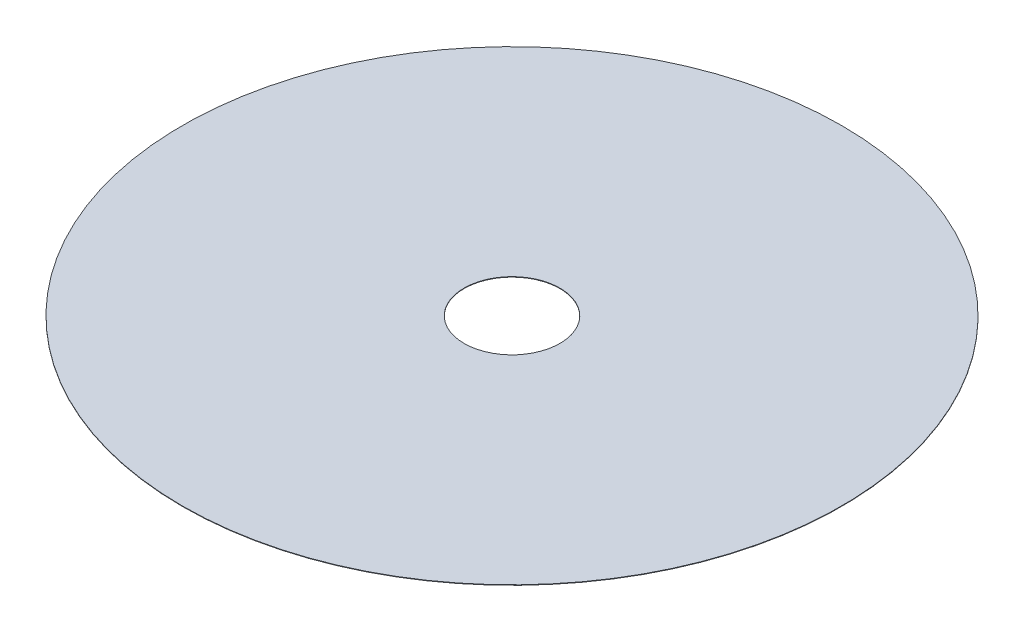
ISO-10303-21;
HEADER;
FILE_DESCRIPTION(('STEP AP214'),'2;1');
FILE_NAME('part.step','',(''),(''),'','','');
FILE_SCHEMA(('AUTOMOTIVE_DESIGN { 1 0 10303 214 1 1 1 1 }'));
ENDSEC;
DATA;
#1=APPLICATION_CONTEXT('core data for automotive mechanical design processes');
#2=APPLICATION_PROTOCOL_DEFINITION('international standard','automotive_design',2000,#1);
#3=PRODUCT_CONTEXT('',#1,'mechanical');
#4=PRODUCT('Part','Part','',(#3));
#5=PRODUCT_RELATED_PRODUCT_CATEGORY('part','',(#4));
#6=PRODUCT_DEFINITION_FORMATION('','',#4);
#7=PRODUCT_DEFINITION_CONTEXT('part definition',#1,'design');
#8=PRODUCT_DEFINITION('design','',#6,#7);
#9=PRODUCT_DEFINITION_SHAPE('','',#8);
#10=(LENGTH_UNIT() NAMED_UNIT(*) SI_UNIT(.MILLI.,.METRE.));
#11=(NAMED_UNIT(*) PLANE_ANGLE_UNIT() SI_UNIT($,.RADIAN.));
#12=(NAMED_UNIT(*) SI_UNIT($,.STERADIAN.) SOLID_ANGLE_UNIT());
#13=UNCERTAINTY_MEASURE_WITH_UNIT(LENGTH_MEASURE(1.E-05),#10,'distance_accuracy_value','');
#14=(GEOMETRIC_REPRESENTATION_CONTEXT(3) GLOBAL_UNCERTAINTY_ASSIGNED_CONTEXT((#13)) GLOBAL_UNIT_ASSIGNED_CONTEXT((#10,
#11,#12)) REPRESENTATION_CONTEXT('',''));
#15=CARTESIAN_POINT('',(0.,0.,0.));
#16=DIRECTION('',(0.,0.,1.));
#17=DIRECTION('',(1.,0.,0.));
#18=AXIS2_PLACEMENT_3D('',#15,#16,#17);
#19=CARTESIAN_POINT('',(0.,38.1,0.));
#20=DIRECTION('',(0.,-1.,0.));
#21=DIRECTION('',(0.,0.,-1.));
#22=AXIS2_PLACEMENT_3D('',#19,#20,#21);
#23=CYLINDRICAL_SURFACE('',#22,27500.);
#24=CARTESIAN_POINT('',(0.,38.1,0.));
#25=DIRECTION('',(0.,1.,0.));
#26=DIRECTION('',(0.,0.,1.));
#27=AXIS2_PLACEMENT_3D('',#24,#25,#26);
#28=CIRCLE('',#27,27500.);
#29=CARTESIAN_POINT('',(0.,38.1,27500.));
#30=VERTEX_POINT('',#29);
#31=EDGE_CURVE('E10',#30,#30,#28,.T.);
#32=ORIENTED_EDGE('',*,*,#31,.F.);
#33=EDGE_LOOP('',(#32));
#34=FACE_BOUND('',#33,.T.);
#35=CARTESIAN_POINT('',(0.,0.,0.));
#36=DIRECTION('',(0.,1.,0.));
#37=DIRECTION('',(0.,0.,1.));
#38=AXIS2_PLACEMENT_3D('',#35,#36,#37);
#39=CIRCLE('',#38,27500.);
#40=CARTESIAN_POINT('',(0.,0.,27500.));
#41=VERTEX_POINT('',#40);
#42=EDGE_CURVE('E46',#41,#41,#39,.T.);
#43=ORIENTED_EDGE('',*,*,#42,.T.);
#44=EDGE_LOOP('',(#43));
#45=FACE_BOUND('',#44,.T.);
#46=ADVANCED_FACE('F43',(#34,#45),#23,.T.);
#47=CARTESIAN_POINT('',(0.,38.1,0.));
#48=DIRECTION('',(0.,1.,0.));
#49=DIRECTION('',(0.,0.,1.));
#50=AXIS2_PLACEMENT_3D('',#47,#48,#49);
#51=PLANE('',#50);
#52=CARTESIAN_POINT('',(0.,38.1,0.));
#53=DIRECTION('',(0.,1.,0.));
#54=DIRECTION('',(0.,0.,1.));
#55=AXIS2_PLACEMENT_3D('',#52,#53,#54);
#56=CIRCLE('',#55,4000.);
#57=CARTESIAN_POINT('',(0.,38.1,4000.));
#58=VERTEX_POINT('',#57);
#59=EDGE_CURVE('E57',#58,#58,#56,.T.);
#60=ORIENTED_EDGE('',*,*,#59,.F.);
#61=EDGE_LOOP('',(#60));
#62=FACE_BOUND('',#61,.T.);
#63=ORIENTED_EDGE('',*,*,#31,.T.);
#64=EDGE_LOOP('',(#63));
#65=FACE_BOUND('',#64,.T.);
#66=ADVANCED_FACE('F74',(#62,#65),#51,.T.);
#67=CARTESIAN_POINT('',(0.,0.,0.));
#68=DIRECTION('',(0.,1.,0.));
#69=DIRECTION('',(0.,0.,1.));
#70=AXIS2_PLACEMENT_3D('',#67,#68,#69);
#71=PLANE('',#70);
#72=CARTESIAN_POINT('',(0.,0.,0.));
#73=DIRECTION('',(0.,1.,0.));
#74=DIRECTION('',(0.,0.,1.));
#75=AXIS2_PLACEMENT_3D('',#72,#73,#74);
#76=CIRCLE('',#75,4000.);
#77=CARTESIAN_POINT('',(0.,0.,4000.));
#78=VERTEX_POINT('',#77);
#79=EDGE_CURVE('E55',#78,#78,#76,.T.);
#80=ORIENTED_EDGE('',*,*,#79,.T.);
#81=EDGE_LOOP('',(#80));
#82=FACE_BOUND('',#81,.T.);
#83=ORIENTED_EDGE('',*,*,#42,.F.);
#84=EDGE_LOOP('',(#83));
#85=FACE_BOUND('',#84,.T.);
#86=ADVANCED_FACE('F65',(#82,#85),#71,.F.);
#87=CARTESIAN_POINT('',(0.,0.,0.));
#88=DIRECTION('',(0.,1.,0.));
#89=DIRECTION('',(0.,0.,1.));
#90=AXIS2_PLACEMENT_3D('',#87,#88,#89);
#91=CYLINDRICAL_SURFACE('',#90,4000.);
#92=ORIENTED_EDGE('',*,*,#79,.F.);
#93=EDGE_LOOP('',(#92));
#94=FACE_BOUND('',#93,.T.);
#95=ORIENTED_EDGE('',*,*,#59,.T.);
#96=EDGE_LOOP('',(#95));
#97=FACE_BOUND('',#96,.T.);
#98=ADVANCED_FACE('F68',(#94,#97),#91,.F.);
#99=CLOSED_SHELL('',(#46,#66,#86,#98));
#100=MANIFOLD_SOLID_BREP('B2',#99);
#101=ADVANCED_BREP_SHAPE_REPRESENTATION('',(#18,#100),#14);
#102=SHAPE_DEFINITION_REPRESENTATION(#9,#101);
ENDSEC;
END-ISO-10303-21;
